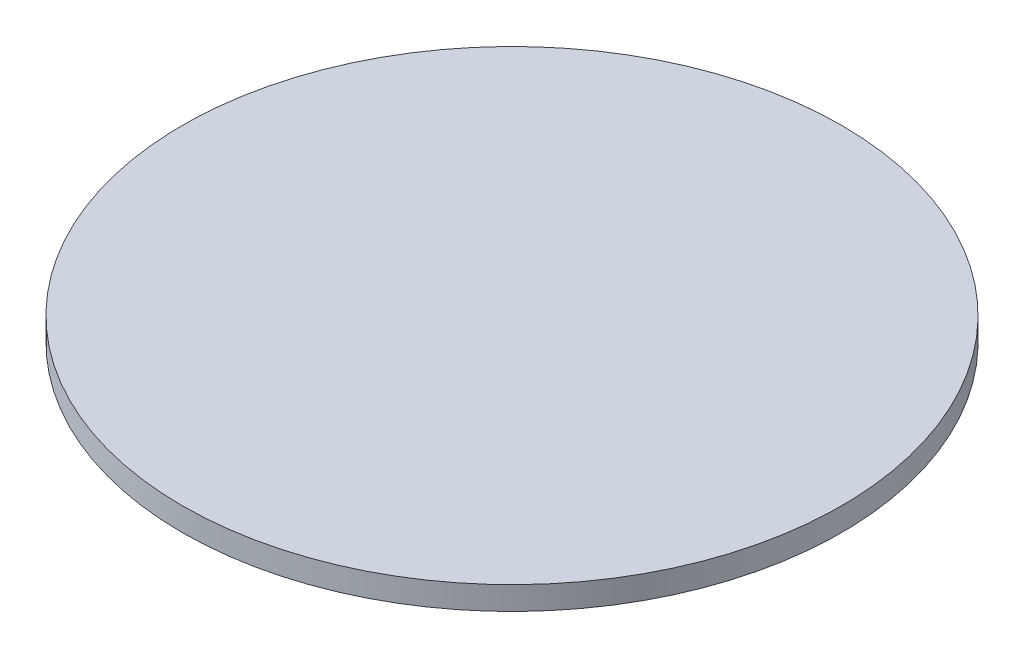
ISO-10303-21;
HEADER;
FILE_DESCRIPTION(('STEP AP214'),'2;1');
FILE_NAME('part.step','',(''),(''),'','','');
FILE_SCHEMA(('AUTOMOTIVE_DESIGN { 1 0 10303 214 1 1 1 1 }'));
ENDSEC;
DATA;
#1=APPLICATION_CONTEXT('core data for automotive mechanical design processes');
#2=APPLICATION_PROTOCOL_DEFINITION('international standard','automotive_design',2000,#1);
#3=PRODUCT_CONTEXT('',#1,'mechanical');
#4=PRODUCT('Part','Part','',(#3));
#5=PRODUCT_RELATED_PRODUCT_CATEGORY('part','',(#4));
#6=PRODUCT_DEFINITION_FORMATION('','',#4);
#7=PRODUCT_DEFINITION_CONTEXT('part definition',#1,'design');
#8=PRODUCT_DEFINITION('design','',#6,#7);
#9=PRODUCT_DEFINITION_SHAPE('','',#8);
#10=(LENGTH_UNIT() NAMED_UNIT(*) SI_UNIT(.MILLI.,.METRE.));
#11=(NAMED_UNIT(*) PLANE_ANGLE_UNIT() SI_UNIT($,.RADIAN.));
#12=(NAMED_UNIT(*) SI_UNIT($,.STERADIAN.) SOLID_ANGLE_UNIT());
#13=UNCERTAINTY_MEASURE_WITH_UNIT(LENGTH_MEASURE(1.E-05),#10,'distance_accuracy_value','');
#14=(GEOMETRIC_REPRESENTATION_CONTEXT(3) GLOBAL_UNCERTAINTY_ASSIGNED_CONTEXT((#13)) GLOBAL_UNIT_ASSIGNED_CONTEXT((#10,
#11,#12)) REPRESENTATION_CONTEXT('',''));
#15=CARTESIAN_POINT('',(0.,0.,0.));
#16=DIRECTION('',(0.,0.,1.));
#17=DIRECTION('',(1.,0.,0.));
#18=AXIS2_PLACEMENT_3D('',#15,#16,#17);
#19=CARTESIAN_POINT('',(0.,3.175,0.));
#20=DIRECTION('',(0.,-1.,0.));
#21=DIRECTION('',(0.,0.,-1.));
#22=AXIS2_PLACEMENT_3D('',#19,#20,#21);
#23=CYLINDRICAL_SURFACE('',#22,45.);
#24=CARTESIAN_POINT('',(0.,3.175,0.));
#25=DIRECTION('',(0.,1.,0.));
#26=DIRECTION('',(0.,0.,1.));
#27=AXIS2_PLACEMENT_3D('',#24,#25,#26);
#28=CIRCLE('',#27,45.);
#29=CARTESIAN_POINT('',(0.,3.175,45.));
#30=VERTEX_POINT('',#29);
#31=EDGE_CURVE('E10',#30,#30,#28,.T.);
#32=ORIENTED_EDGE('',*,*,#31,.F.);
#33=EDGE_LOOP('',(#32));
#34=FACE_BOUND('',#33,.T.);
#35=CARTESIAN_POINT('',(0.,0.,0.));
#36=DIRECTION('',(0.,1.,0.));
#37=DIRECTION('',(0.,0.,1.));
#38=AXIS2_PLACEMENT_3D('',#35,#36,#37);
#39=CIRCLE('',#38,45.);
#40=CARTESIAN_POINT('',(0.,0.,45.));
#41=VERTEX_POINT('',#40);
#42=EDGE_CURVE('E33',#41,#41,#39,.T.);
#43=ORIENTED_EDGE('',*,*,#42,.T.);
#44=EDGE_LOOP('',(#43));
#45=FACE_BOUND('',#44,.T.);
#46=ADVANCED_FACE('F30',(#34,#45),#23,.T.);
#47=CARTESIAN_POINT('',(0.,3.175,0.));
#48=DIRECTION('',(0.,1.,0.));
#49=DIRECTION('',(0.,0.,1.));
#50=AXIS2_PLACEMENT_3D('',#47,#48,#49);
#51=PLANE('',#50);
#52=ORIENTED_EDGE('',*,*,#31,.T.);
#53=EDGE_LOOP('',(#52));
#54=FACE_BOUND('',#53,.T.);
#55=ADVANCED_FACE('F45',(#54),#51,.T.);
#56=CARTESIAN_POINT('',(0.,0.,0.));
#57=DIRECTION('',(0.,1.,0.));
#58=DIRECTION('',(0.,0.,1.));
#59=AXIS2_PLACEMENT_3D('',#56,#57,#58);
#60=PLANE('',#59);
#61=ORIENTED_EDGE('',*,*,#42,.F.);
#62=EDGE_LOOP('',(#61));
#63=FACE_BOUND('',#62,.T.);
#64=ADVANCED_FACE('F43',(#63),#60,.F.);
#65=CLOSED_SHELL('',(#46,#55,#64));
#66=MANIFOLD_SOLID_BREP('B2',#65);
#67=ADVANCED_BREP_SHAPE_REPRESENTATION('',(#18,#66),#14);
#68=SHAPE_DEFINITION_REPRESENTATION(#9,#67);
ENDSEC;
END-ISO-10303-21;
